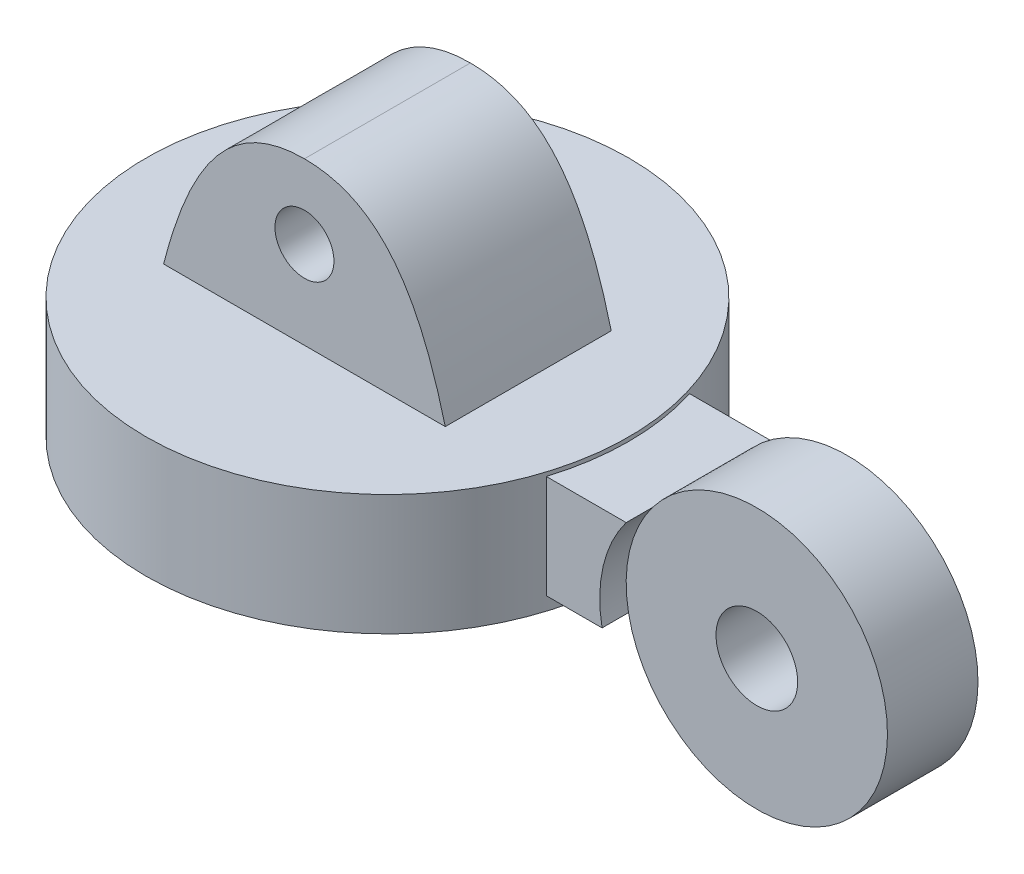
ISO-10303-21;
HEADER;
FILE_DESCRIPTION(('STEP AP214'),'2;1');
FILE_NAME('part.step','',(''),(''),'','','');
FILE_SCHEMA(('AUTOMOTIVE_DESIGN { 1 0 10303 214 1 1 1 1 }'));
ENDSEC;
DATA;
#1=APPLICATION_CONTEXT('core data for automotive mechanical design processes');
#2=APPLICATION_PROTOCOL_DEFINITION('international standard','automotive_design',2000,#1);
#3=PRODUCT_CONTEXT('',#1,'mechanical');
#4=PRODUCT('Part','Part','',(#3));
#5=PRODUCT_RELATED_PRODUCT_CATEGORY('part','',(#4));
#6=PRODUCT_DEFINITION_FORMATION('','',#4);
#7=PRODUCT_DEFINITION_CONTEXT('part definition',#1,'design');
#8=PRODUCT_DEFINITION('design','',#6,#7);
#9=PRODUCT_DEFINITION_SHAPE('','',#8);
#10=(LENGTH_UNIT() NAMED_UNIT(*) SI_UNIT(.MILLI.,.METRE.));
#11=(NAMED_UNIT(*) PLANE_ANGLE_UNIT() SI_UNIT($,.RADIAN.));
#12=(NAMED_UNIT(*) SI_UNIT($,.STERADIAN.) SOLID_ANGLE_UNIT());
#13=UNCERTAINTY_MEASURE_WITH_UNIT(LENGTH_MEASURE(1.E-05),#10,'distance_accuracy_value','');
#14=(GEOMETRIC_REPRESENTATION_CONTEXT(3) GLOBAL_UNCERTAINTY_ASSIGNED_CONTEXT((#13)) GLOBAL_UNIT_ASSIGNED_CONTEXT((#10,
#11,#12)) REPRESENTATION_CONTEXT('',''));
#15=CARTESIAN_POINT('',(0.,0.,0.));
#16=DIRECTION('',(0.,0.,1.));
#17=DIRECTION('',(1.,0.,0.));
#18=AXIS2_PLACEMENT_3D('',#15,#16,#17);
#19=CARTESIAN_POINT('',(54.96374577033,5.03116871619943,9.5));
#20=DIRECTION('',(0.,0.,-1.));
#21=DIRECTION('',(-1.,0.,0.));
#22=AXIS2_PLACEMENT_3D('',#19,#20,#21);
#23=CYLINDRICAL_SURFACE('',#22,17.3188793455624);
#24=DIRECTION('',(0.,0.,-1.));
#25=VECTOR('',#24,1.);
#26=CARTESIAN_POINT('',(41.1481021691568,15.4749024197898,9.5));
#27=LINE('',#26,#25);
#28=CARTESIAN_POINT('',(41.1481021691568,15.4749024197898,-6.));
#29=VERTEX_POINT('',#28);
#30=CARTESIAN_POINT('',(41.1481021691568,15.4749024197898,-9.5));
#31=VERTEX_POINT('',#30);
#32=EDGE_CURVE('E143',#29,#31,#27,.T.);
#33=ORIENTED_EDGE('',*,*,#32,.F.);
#34=CARTESIAN_POINT('',(54.96374577033,5.03116871619943,-6.));
#35=DIRECTION('',(0.,0.,1.));
#36=DIRECTION('',(1.,0.,0.));
#37=AXIS2_PLACEMENT_3D('',#34,#35,#36);
#38=CIRCLE('',#37,17.3188793455624);
#39=CARTESIAN_POINT('',(37.9520377160229,1.78380503758744,-6.));
#40=VERTEX_POINT('',#39);
#41=EDGE_CURVE('E134',#29,#40,#38,.T.);
#42=ORIENTED_EDGE('',*,*,#41,.T.);
#43=DIRECTION('',(0.,0.,-1.));
#44=VECTOR('',#43,1.);
#45=CARTESIAN_POINT('',(37.9520377160229,1.78380503758744,9.5));
#46=LINE('',#45,#44);
#47=CARTESIAN_POINT('',(37.9520377160229,1.78380503758744,-9.5));
#48=VERTEX_POINT('',#47);
#49=EDGE_CURVE('E323',#40,#48,#46,.T.);
#50=ORIENTED_EDGE('',*,*,#49,.T.);
#51=CARTESIAN_POINT('',(54.96374577033,5.03116871619943,-9.5));
#52=DIRECTION('',(0.,0.,1.));
#53=DIRECTION('',(1.,0.,0.));
#54=AXIS2_PLACEMENT_3D('',#51,#52,#53);
#55=CIRCLE('',#54,17.3188793455624);
#56=EDGE_CURVE('E145',#31,#48,#55,.T.);
#57=ORIENTED_EDGE('',*,*,#56,.F.);
#58=EDGE_LOOP('',(#33,#42,#50,#57));
#59=FACE_BOUND('',#58,.T.);
#60=ADVANCED_FACE('F35',(#59),#23,.F.);
#61=CARTESIAN_POINT('',(0.,16.,0.));
#62=DIRECTION('',(0.,1.,0.));
#63=DIRECTION('',(0.,0.,1.));
#64=AXIS2_PLACEMENT_3D('',#61,#62,#63);
#65=PLANE('',#64);
#66=CARTESIAN_POINT('',(0.,16.,0.));
#67=DIRECTION('',(0.,1.,0.));
#68=DIRECTION('',(0.,0.,1.));
#69=AXIS2_PLACEMENT_3D('',#66,#67,#68);
#70=CIRCLE('',#69,32.0074650346705);
#71=CARTESIAN_POINT('',(0.,16.,32.0074650346705));
#72=VERTEX_POINT('',#71);
#73=EDGE_CURVE('E316',#72,#72,#70,.T.);
#74=ORIENTED_EDGE('',*,*,#73,.T.);
#75=EDGE_LOOP('',(#74));
#76=FACE_BOUND('',#75,.T.);
#77=DIRECTION('',(1.,0.,0.));
#78=VECTOR('',#77,1.);
#79=CARTESIAN_POINT('',(18.6664529568385,16.,11.));
#80=LINE('',#79,#78);
#81=CARTESIAN_POINT('',(-18.6664529568385,16.,11.));
#82=VERTEX_POINT('',#81);
#83=CARTESIAN_POINT('',(18.6664529568385,16.,11.));
#84=VERTEX_POINT('',#83);
#85=EDGE_CURVE('E189',#82,#84,#80,.T.);
#86=ORIENTED_EDGE('',*,*,#85,.F.);
#87=DIRECTION('',(0.,0.,-1.));
#88=VECTOR('',#87,1.);
#89=CARTESIAN_POINT('',(-18.6664529568385,16.,11.));
#90=LINE('',#89,#88);
#91=CARTESIAN_POINT('',(-18.6664529568385,16.,-11.));
#92=VERTEX_POINT('',#91);
#93=EDGE_CURVE('E309',#82,#92,#90,.T.);
#94=ORIENTED_EDGE('',*,*,#93,.T.);
#95=DIRECTION('',(1.,0.,0.));
#96=VECTOR('',#95,1.);
#97=CARTESIAN_POINT('',(18.6664529568385,16.,-11.));
#98=LINE('',#97,#96);
#99=CARTESIAN_POINT('',(18.6664529568385,16.,-11.));
#100=VERTEX_POINT('',#99);
#101=EDGE_CURVE('E542',#92,#100,#98,.T.);
#102=ORIENTED_EDGE('',*,*,#101,.T.);
#103=DIRECTION('',(0.,0.,-1.));
#104=VECTOR('',#103,1.);
#105=CARTESIAN_POINT('',(18.6664529568385,16.,11.));
#106=LINE('',#105,#104);
#107=EDGE_CURVE('E529',#84,#100,#106,.T.);
#108=ORIENTED_EDGE('',*,*,#107,.F.);
#109=EDGE_LOOP('',(#86,#94,#102,#108));
#110=FACE_BOUND('',#109,.T.);
#111=ADVANCED_FACE('F218',(#76,#110),#65,.T.);
#112=CARTESIAN_POINT('',(0.,16.,0.));
#113=DIRECTION('',(0.,-1.,0.));
#114=DIRECTION('',(0.,0.,-1.));
#115=AXIS2_PLACEMENT_3D('',#112,#113,#114);
#116=CYLINDRICAL_SURFACE('',#115,32.0074650346705);
#117=CARTESIAN_POINT('',(0.,1.78380503758744,0.));
#118=DIRECTION('',(0.,1.,0.));
#119=DIRECTION('',(0.,0.,1.));
#120=AXIS2_PLACEMENT_3D('',#117,#118,#119);
#121=CIRCLE('',#120,32.0074650346705);
#122=CARTESIAN_POINT('',(30.5651405680663,1.78380503758744,9.5));
#123=VERTEX_POINT('',#122);
#124=CARTESIAN_POINT('',(30.5651405680663,1.78380503758744,-9.5));
#125=VERTEX_POINT('',#124);
#126=EDGE_CURVE('E174',#123,#125,#121,.T.);
#127=ORIENTED_EDGE('',*,*,#126,.F.);
#128=DIRECTION('',(0.,-1.,0.));
#129=VECTOR('',#128,1.);
#130=CARTESIAN_POINT('',(30.5651405680663,16.,9.5));
#131=LINE('',#130,#129);
#132=CARTESIAN_POINT('',(30.5651405680663,15.4749024197898,9.5));
#133=VERTEX_POINT('',#132);
#134=EDGE_CURVE('E56',#123,#133,#131,.F.);
#135=ORIENTED_EDGE('',*,*,#134,.T.);
#136=CARTESIAN_POINT('',(0.,15.4749024197898,0.));
#137=DIRECTION('',(0.,1.,0.));
#138=DIRECTION('',(0.,0.,1.));
#139=AXIS2_PLACEMENT_3D('',#136,#137,#138);
#140=CIRCLE('',#139,32.0074650346705);
#141=CARTESIAN_POINT('',(30.5651405680663,15.4749024197898,-9.5));
#142=VERTEX_POINT('',#141);
#143=EDGE_CURVE('E11',#133,#142,#140,.T.);
#144=ORIENTED_EDGE('',*,*,#143,.T.);
#145=DIRECTION('',(0.,-1.,0.));
#146=VECTOR('',#145,1.);
#147=CARTESIAN_POINT('',(30.5651405680663,16.,-9.5));
#148=LINE('',#147,#146);
#149=EDGE_CURVE('E163',#125,#142,#148,.F.);
#150=ORIENTED_EDGE('',*,*,#149,.F.);
#151=EDGE_LOOP('',(#127,#135,#144,#150));
#152=FACE_BOUND('',#151,.T.);
#153=ORIENTED_EDGE('',*,*,#73,.F.);
#154=EDGE_LOOP('',(#153));
#155=FACE_BOUND('',#154,.T.);
#156=CARTESIAN_POINT('',(0.,0.,0.));
#157=DIRECTION('',(0.,1.,0.));
#158=DIRECTION('',(0.,0.,1.));
#159=AXIS2_PLACEMENT_3D('',#156,#157,#158);
#160=CIRCLE('',#159,32.0074650346705);
#161=CARTESIAN_POINT('',(0.,0.,32.0074650346705));
#162=VERTEX_POINT('',#161);
#163=EDGE_CURVE('E314',#162,#162,#160,.T.);
#164=ORIENTED_EDGE('',*,*,#163,.T.);
#165=EDGE_LOOP('',(#164));
#166=FACE_BOUND('',#165,.T.);
#167=ADVANCED_FACE('F37',(#152,#155,#166),#116,.T.);
#168=CARTESIAN_POINT('',(0.,0.,0.));
#169=DIRECTION('',(0.,1.,0.));
#170=DIRECTION('',(0.,0.,1.));
#171=AXIS2_PLACEMENT_3D('',#168,#169,#170);
#172=PLANE('',#171);
#173=CARTESIAN_POINT('',(0.,0.,0.));
#174=DIRECTION('',(0.,-1.,0.));
#175=DIRECTION('',(0.,0.,-1.));
#176=AXIS2_PLACEMENT_3D('',#173,#174,#175);
#177=CIRCLE('',#176,29.2395080001266);
#178=CARTESIAN_POINT('',(0.,0.,-29.2395080001266));
#179=VERTEX_POINT('',#178);
#180=EDGE_CURVE('E303',#179,#179,#177,.T.);
#181=ORIENTED_EDGE('',*,*,#180,.F.);
#182=EDGE_LOOP('',(#181));
#183=FACE_BOUND('',#182,.T.);
#184=ORIENTED_EDGE('',*,*,#163,.F.);
#185=EDGE_LOOP('',(#184));
#186=FACE_BOUND('',#185,.T.);
#187=ADVANCED_FACE('F216',(#183,#186),#172,.F.);
#188=CARTESIAN_POINT('',(0.,3.,0.));
#189=DIRECTION('',(0.,-1.,0.));
#190=DIRECTION('',(0.,0.,-1.));
#191=AXIS2_PLACEMENT_3D('',#188,#189,#190);
#192=CYLINDRICAL_SURFACE('',#191,29.2395080001266);
#193=CARTESIAN_POINT('',(0.,3.,0.));
#194=DIRECTION('',(0.,-1.,0.));
#195=DIRECTION('',(0.,0.,-1.));
#196=AXIS2_PLACEMENT_3D('',#193,#194,#195);
#197=CIRCLE('',#196,29.2395080001266);
#198=CARTESIAN_POINT('',(27.653188389216,3.,9.5));
#199=VERTEX_POINT('',#198);
#200=CARTESIAN_POINT('',(27.653188389216,3.,-9.5));
#201=VERTEX_POINT('',#200);
#202=EDGE_CURVE('E295',#199,#201,#197,.T.);
#203=ORIENTED_EDGE('',*,*,#202,.F.);
#204=DIRECTION('',(0.,-1.,0.));
#205=VECTOR('',#204,1.);
#206=CARTESIAN_POINT('',(27.653188389216,3.,9.5));
#207=LINE('',#206,#205);
#208=CARTESIAN_POINT('',(27.653188389216,1.78380503758744,9.5));
#209=VERTEX_POINT('',#208);
#210=EDGE_CURVE('E168',#199,#209,#207,.T.);
#211=ORIENTED_EDGE('',*,*,#210,.T.);
#212=CARTESIAN_POINT('',(0.,1.78380503758744,0.));
#213=DIRECTION('',(0.,1.,0.));
#214=DIRECTION('',(0.,0.,1.));
#215=AXIS2_PLACEMENT_3D('',#212,#213,#214);
#216=CIRCLE('',#215,29.2395080001266);
#217=CARTESIAN_POINT('',(27.653188389216,1.78380503758744,-9.5));
#218=VERTEX_POINT('',#217);
#219=EDGE_CURVE('E172',#218,#209,#216,.F.);
#220=ORIENTED_EDGE('',*,*,#219,.F.);
#221=DIRECTION('',(0.,-1.,0.));
#222=VECTOR('',#221,1.);
#223=CARTESIAN_POINT('',(27.653188389216,3.,-9.5));
#224=LINE('',#223,#222);
#225=EDGE_CURVE('E161',#201,#218,#224,.T.);
#226=ORIENTED_EDGE('',*,*,#225,.F.);
#227=EDGE_LOOP('',(#203,#211,#220,#226));
#228=FACE_BOUND('',#227,.T.);
#229=ORIENTED_EDGE('',*,*,#180,.T.);
#230=EDGE_LOOP('',(#229));
#231=FACE_BOUND('',#230,.T.);
#232=ADVANCED_FACE('F212',(#228,#231),#192,.F.);
#233=CARTESIAN_POINT('',(0.,3.,0.));
#234=DIRECTION('',(0.,-1.,0.));
#235=DIRECTION('',(0.,0.,-1.));
#236=AXIS2_PLACEMENT_3D('',#233,#234,#235);
#237=PLANE('',#236);
#238=DIRECTION('',(-1.,0.,0.));
#239=VECTOR('',#238,1.);
#240=CARTESIAN_POINT('',(0.,3.,9.5));
#241=LINE('',#240,#239);
#242=CARTESIAN_POINT('',(25.3389228621008,3.,9.5));
#243=VERTEX_POINT('',#242);
#244=EDGE_CURVE('E166',#199,#243,#241,.T.);
#245=ORIENTED_EDGE('',*,*,#244,.F.);
#246=ORIENTED_EDGE('',*,*,#202,.T.);
#247=DIRECTION('',(-1.,0.,0.));
#248=VECTOR('',#247,1.);
#249=CARTESIAN_POINT('',(0.,3.,-9.5));
#250=LINE('',#249,#248);
#251=CARTESIAN_POINT('',(25.3389228621008,3.,-9.5));
#252=VERTEX_POINT('',#251);
#253=EDGE_CURVE('E155',#201,#252,#250,.T.);
#254=ORIENTED_EDGE('',*,*,#253,.T.);
#255=CARTESIAN_POINT('',(-0.468052939027075,3.,0.));
#256=DIRECTION('',(0.,-1.,0.));
#257=DIRECTION('',(0.,0.,-1.));
#258=AXIS2_PLACEMENT_3D('',#255,#256,#257);
#259=CIRCLE('',#258,27.5);
#260=EDGE_CURVE('E302',#243,#252,#259,.T.);
#261=ORIENTED_EDGE('',*,*,#260,.F.);
#262=EDGE_LOOP('',(#245,#246,#254,#261));
#263=FACE_BOUND('',#262,.T.);
#264=ADVANCED_FACE('F208',(#263),#237,.T.);
#265=CARTESIAN_POINT('',(-0.468052939027075,3.,0.));
#266=DIRECTION('',(0.,-1.,0.));
#267=DIRECTION('',(0.,0.,-1.));
#268=AXIS2_PLACEMENT_3D('',#265,#266,#267);
#269=CYLINDRICAL_SURFACE('',#268,27.5);
#270=DIRECTION('',(0.,-1.,0.));
#271=VECTOR('',#270,1.);
#272=CARTESIAN_POINT('',(25.3389228621008,3.,9.5));
#273=LINE('',#272,#271);
#274=CARTESIAN_POINT('',(25.3389228621008,1.78380503758744,9.5));
#275=VERTEX_POINT('',#274);
#276=EDGE_CURVE('E43',#243,#275,#273,.T.);
#277=ORIENTED_EDGE('',*,*,#276,.F.);
#278=ORIENTED_EDGE('',*,*,#260,.T.);
#279=DIRECTION('',(0.,-1.,0.));
#280=VECTOR('',#279,1.);
#281=CARTESIAN_POINT('',(25.3389228621008,3.,-9.5));
#282=LINE('',#281,#280);
#283=CARTESIAN_POINT('',(25.3389228621008,1.78380503758744,-9.5));
#284=VERTEX_POINT('',#283);
#285=EDGE_CURVE('E319',#252,#284,#282,.T.);
#286=ORIENTED_EDGE('',*,*,#285,.T.);
#287=CARTESIAN_POINT('',(-0.468052939027075,1.78380503758744,0.));
#288=DIRECTION('',(0.,1.,0.));
#289=DIRECTION('',(0.,0.,1.));
#290=AXIS2_PLACEMENT_3D('',#287,#288,#289);
#291=CIRCLE('',#290,27.5);
#292=EDGE_CURVE('E288',#284,#275,#291,.F.);
#293=ORIENTED_EDGE('',*,*,#292,.T.);
#294=EDGE_LOOP('',(#277,#278,#286,#293));
#295=FACE_BOUND('',#294,.T.);
#296=CARTESIAN_POINT('',(-0.468052939027075,0.,0.));
#297=DIRECTION('',(0.,-1.,0.));
#298=DIRECTION('',(0.,0.,-1.));
#299=AXIS2_PLACEMENT_3D('',#296,#297,#298);
#300=CIRCLE('',#299,27.5);
#301=CARTESIAN_POINT('',(-0.468052939027075,0.,-27.5));
#302=VERTEX_POINT('',#301);
#303=EDGE_CURVE('E304',#302,#302,#300,.T.);
#304=ORIENTED_EDGE('',*,*,#303,.F.);
#305=EDGE_LOOP('',(#304));
#306=FACE_BOUND('',#305,.T.);
#307=ADVANCED_FACE('F204',(#295,#306),#269,.T.);
#308=ORIENTED_EDGE('',*,*,#303,.T.);
#309=EDGE_LOOP('',(#308));
#310=FACE_BOUND('',#309,.T.);
#311=ADVANCED_FACE('F207',(#310),#172,.F.);
#312=CARTESIAN_POINT('',(-11.6227277255258,31.9146270543991,11.));
#313=DIRECTION('',(0.,0.,1.));
#314=DIRECTION('',(1.,0.,0.));
#315=AXIS2_PLACEMENT_3D('',#312,#313,#314);
#316=PLANE('',#315);
#317=CARTESIAN_POINT('',(0.,37.4124179490394,11.));
#318=CARTESIAN_POINT('',(-9.66036103965406,37.4124179490394,11.));
#319=CARTESIAN_POINT('',(-15.1114285761352,29.8891148796784,11.));
#320=CARTESIAN_POINT('',(-18.6664529568385,16.,11.));
#321=B_SPLINE_CURVE_WITH_KNOTS('',3,(#317,#318,#319,#320),.UNSPECIFIED.,.F.,.F.,(4,4),(0.,1.),.UNSPECIFIED.);
#322=CARTESIAN_POINT('',(0.,37.4124179490394,11.));
#323=VERTEX_POINT('',#322);
#324=EDGE_CURVE('E184',#323,#82,#321,.T.);
#325=ORIENTED_EDGE('',*,*,#324,.T.);
#326=ORIENTED_EDGE('',*,*,#85,.T.);
#327=CARTESIAN_POINT('',(18.6664529568385,16.,11.));
#328=CARTESIAN_POINT('',(15.1114285761352,29.8891148796784,11.));
#329=CARTESIAN_POINT('',(9.66036103965406,37.4124179490394,11.));
#330=CARTESIAN_POINT('',(0.,37.4124179490394,11.));
#331=B_SPLINE_CURVE_WITH_KNOTS('',3,(#327,#328,#329,#330),.UNSPECIFIED.,.F.,.F.,(4,4),(0.,1.),.UNSPECIFIED.);
#332=EDGE_CURVE('E521',#84,#323,#331,.T.);
#333=ORIENTED_EDGE('',*,*,#332,.T.);
#334=EDGE_LOOP('',(#325,#326,#333));
#335=FACE_BOUND('',#334,.T.);
#336=CARTESIAN_POINT('',(0.,27.6027847450147,11.));
#337=DIRECTION('',(0.,0.,1.));
#338=DIRECTION('',(1.,0.,0.));
#339=AXIS2_PLACEMENT_3D('',#336,#337,#338);
#340=CIRCLE('',#339,3.90970017860598);
#341=CARTESIAN_POINT('',(3.90970017860601,27.6027847450147,11.));
#342=VERTEX_POINT('',#341);
#343=EDGE_CURVE('E178',#342,#342,#340,.T.);
#344=ORIENTED_EDGE('',*,*,#343,.F.);
#345=EDGE_LOOP('',(#344));
#346=FACE_BOUND('',#345,.T.);
#347=ADVANCED_FACE('F229',(#335,#346),#316,.T.);
#348=CARTESIAN_POINT('',(-11.6227277255258,31.9146270543991,-11.));
#349=DIRECTION('',(0.,0.,1.));
#350=DIRECTION('',(1.,0.,0.));
#351=AXIS2_PLACEMENT_3D('',#348,#349,#350);
#352=PLANE('',#351);
#353=CARTESIAN_POINT('',(0.,37.4124179490394,-11.));
#354=CARTESIAN_POINT('',(-9.66036103965406,37.4124179490394,-11.));
#355=CARTESIAN_POINT('',(-15.1114285761352,29.8891148796784,-11.));
#356=CARTESIAN_POINT('',(-18.6664529568385,16.,-11.));
#357=B_SPLINE_CURVE_WITH_KNOTS('',3,(#353,#354,#355,#356),.UNSPECIFIED.,.F.,.F.,(4,4),(0.,1.),.UNSPECIFIED.);
#358=CARTESIAN_POINT('',(0.,37.4124179490394,-11.));
#359=VERTEX_POINT('',#358);
#360=EDGE_CURVE('E181',#359,#92,#357,.T.);
#361=ORIENTED_EDGE('',*,*,#360,.F.);
#362=CARTESIAN_POINT('',(18.6664529568385,16.,-11.));
#363=CARTESIAN_POINT('',(15.1114285761352,29.8891148796784,-11.));
#364=CARTESIAN_POINT('',(9.66036103965406,37.4124179490394,-11.));
#365=CARTESIAN_POINT('',(0.,37.4124179490394,-11.));
#366=B_SPLINE_CURVE_WITH_KNOTS('',3,(#362,#363,#364,#365),.UNSPECIFIED.,.F.,.F.,(4,4),(0.,1.),.UNSPECIFIED.);
#367=EDGE_CURVE('E190',#100,#359,#366,.T.);
#368=ORIENTED_EDGE('',*,*,#367,.F.);
#369=ORIENTED_EDGE('',*,*,#101,.F.);
#370=EDGE_LOOP('',(#361,#368,#369));
#371=FACE_BOUND('',#370,.T.);
#372=CARTESIAN_POINT('',(0.,27.6027847450147,-11.));
#373=DIRECTION('',(0.,0.,1.));
#374=DIRECTION('',(1.,0.,0.));
#375=AXIS2_PLACEMENT_3D('',#372,#373,#374);
#376=CIRCLE('',#375,3.90970017860598);
#377=CARTESIAN_POINT('',(3.90970017860601,27.6027847450147,-11.));
#378=VERTEX_POINT('',#377);
#379=EDGE_CURVE('E177',#378,#378,#376,.T.);
#380=ORIENTED_EDGE('',*,*,#379,.T.);
#381=EDGE_LOOP('',(#380));
#382=FACE_BOUND('',#381,.T.);
#383=ADVANCED_FACE('F201',(#371,#382),#352,.F.);
#384=DIRECTION('',(0.,0.,-1.));
#385=VECTOR('',#384,1.);
#386=SURFACE_OF_LINEAR_EXTRUSION('',#321,#385);
#387=ORIENTED_EDGE('',*,*,#360,.T.);
#388=ORIENTED_EDGE('',*,*,#93,.F.);
#389=ORIENTED_EDGE('',*,*,#324,.F.);
#390=DIRECTION('',(0.,0.,-1.));
#391=VECTOR('',#390,1.);
#392=CARTESIAN_POINT('',(0.,37.4124179490394,11.));
#393=LINE('',#392,#391);
#394=EDGE_CURVE('E530',#323,#359,#393,.T.);
#395=ORIENTED_EDGE('',*,*,#394,.T.);
#396=EDGE_LOOP('',(#387,#388,#389,#395));
#397=FACE_BOUND('',#396,.T.);
#398=ADVANCED_FACE('F196',(#397),#386,.F.);
#399=DIRECTION('',(0.,0.,-1.));
#400=VECTOR('',#399,1.);
#401=SURFACE_OF_LINEAR_EXTRUSION('',#331,#400);
#402=ORIENTED_EDGE('',*,*,#367,.T.);
#403=ORIENTED_EDGE('',*,*,#394,.F.);
#404=ORIENTED_EDGE('',*,*,#332,.F.);
#405=ORIENTED_EDGE('',*,*,#107,.T.);
#406=EDGE_LOOP('',(#402,#403,#404,#405));
#407=FACE_BOUND('',#406,.T.);
#408=ADVANCED_FACE('F200',(#407),#401,.F.);
#409=CARTESIAN_POINT('',(0.,27.6027847450147,11.));
#410=DIRECTION('',(0.,0.,-1.));
#411=DIRECTION('',(-1.,0.,0.));
#412=AXIS2_PLACEMENT_3D('',#409,#410,#411);
#413=CYLINDRICAL_SURFACE('',#412,3.90970017860598);
#414=ORIENTED_EDGE('',*,*,#343,.T.);
#415=EDGE_LOOP('',(#414));
#416=FACE_BOUND('',#415,.T.);
#417=ORIENTED_EDGE('',*,*,#379,.F.);
#418=EDGE_LOOP('',(#417));
#419=FACE_BOUND('',#418,.T.);
#420=ADVANCED_FACE('F332',(#416,#419),#413,.F.);
#421=CARTESIAN_POINT('',(0.,0.,9.5));
#422=DIRECTION('',(0.,0.,1.));
#423=DIRECTION('',(1.,0.,0.));
#424=AXIS2_PLACEMENT_3D('',#421,#422,#423);
#425=PLANE('',#424);
#426=ORIENTED_EDGE('',*,*,#210,.F.);
#427=ORIENTED_EDGE('',*,*,#244,.T.);
#428=ORIENTED_EDGE('',*,*,#276,.T.);
#429=DIRECTION('',(1.,0.,0.));
#430=VECTOR('',#429,1.);
#431=CARTESIAN_POINT('',(0.,1.78380503758744,9.5));
#432=LINE('',#431,#430);
#433=EDGE_CURVE('E274',#275,#209,#432,.T.);
#434=ORIENTED_EDGE('',*,*,#433,.T.);
#435=EDGE_LOOP('',(#426,#427,#428,#434));
#436=FACE_BOUND('',#435,.T.);
#437=ADVANCED_FACE('F298',(#436),#425,.T.);
#438=CARTESIAN_POINT('',(0.,0.,-9.5));
#439=DIRECTION('',(0.,0.,1.));
#440=DIRECTION('',(1.,0.,0.));
#441=AXIS2_PLACEMENT_3D('',#438,#439,#440);
#442=PLANE('',#441);
#443=ORIENTED_EDGE('',*,*,#253,.F.);
#444=ORIENTED_EDGE('',*,*,#225,.T.);
#445=DIRECTION('',(1.,0.,0.));
#446=VECTOR('',#445,1.);
#447=CARTESIAN_POINT('',(0.,1.78380503758744,-9.5));
#448=LINE('',#447,#446);
#449=EDGE_CURVE('E271',#284,#218,#448,.T.);
#450=ORIENTED_EDGE('',*,*,#449,.F.);
#451=ORIENTED_EDGE('',*,*,#285,.F.);
#452=EDGE_LOOP('',(#443,#444,#450,#451));
#453=FACE_BOUND('',#452,.T.);
#454=ADVANCED_FACE('F251',(#453),#442,.F.);
#455=CARTESIAN_POINT('',(0.,1.78380503758744,9.5));
#456=DIRECTION('',(0.,1.,0.));
#457=DIRECTION('',(0.,0.,1.));
#458=AXIS2_PLACEMENT_3D('',#455,#456,#457);
#459=PLANE('',#458);
#460=ORIENTED_EDGE('',*,*,#449,.T.);
#461=ORIENTED_EDGE('',*,*,#219,.T.);
#462=ORIENTED_EDGE('',*,*,#433,.F.);
#463=ORIENTED_EDGE('',*,*,#292,.F.);
#464=EDGE_LOOP('',(#460,#461,#462,#463));
#465=FACE_BOUND('',#464,.T.);
#466=ADVANCED_FACE('F284',(#465),#459,.F.);
#467=CARTESIAN_POINT('',(0.,15.4749024197898,9.5));
#468=DIRECTION('',(0.,1.,0.));
#469=DIRECTION('',(0.,0.,1.));
#470=AXIS2_PLACEMENT_3D('',#467,#468,#469);
#471=PLANE('',#470);
#472=ORIENTED_EDGE('',*,*,#143,.F.);
#473=DIRECTION('',(1.,0.,0.));
#474=VECTOR('',#473,1.);
#475=CARTESIAN_POINT('',(0.,15.4749024197898,9.5));
#476=LINE('',#475,#474);
#477=CARTESIAN_POINT('',(41.1481021691568,15.4749024197898,9.5));
#478=VERTEX_POINT('',#477);
#479=EDGE_CURVE('E270',#133,#478,#476,.T.);
#480=ORIENTED_EDGE('',*,*,#479,.T.);
#481=CARTESIAN_POINT('',(41.1481021691568,15.4749024197898,6.));
#482=VERTEX_POINT('',#481);
#483=EDGE_CURVE('E151',#478,#482,#27,.T.);
#484=ORIENTED_EDGE('',*,*,#483,.T.);
#485=EDGE_CURVE('E129',#482,#29,#27,.T.);
#486=ORIENTED_EDGE('',*,*,#485,.T.);
#487=ORIENTED_EDGE('',*,*,#32,.T.);
#488=DIRECTION('',(1.,0.,0.));
#489=VECTOR('',#488,1.);
#490=CARTESIAN_POINT('',(0.,15.4749024197898,-9.5));
#491=LINE('',#490,#489);
#492=EDGE_CURVE('E262',#142,#31,#491,.T.);
#493=ORIENTED_EDGE('',*,*,#492,.F.);
#494=EDGE_LOOP('',(#472,#480,#484,#486,#487,#493));
#495=FACE_BOUND('',#494,.T.);
#496=ADVANCED_FACE('F153',(#495),#471,.T.);
#497=CARTESIAN_POINT('',(37.9520377160229,1.78380503758744,9.5));
#498=VERTEX_POINT('',#497);
#499=EDGE_CURVE('E273',#123,#498,#432,.T.);
#500=ORIENTED_EDGE('',*,*,#499,.F.);
#501=ORIENTED_EDGE('',*,*,#126,.T.);
#502=EDGE_CURVE('E276',#125,#48,#448,.T.);
#503=ORIENTED_EDGE('',*,*,#502,.T.);
#504=ORIENTED_EDGE('',*,*,#49,.F.);
#505=CARTESIAN_POINT('',(37.9520377160229,1.78380503758744,6.));
#506=VERTEX_POINT('',#505);
#507=EDGE_CURVE('E132',#506,#40,#46,.T.);
#508=ORIENTED_EDGE('',*,*,#507,.F.);
#509=EDGE_CURVE('E149',#498,#506,#46,.T.);
#510=ORIENTED_EDGE('',*,*,#509,.F.);
#511=EDGE_LOOP('',(#500,#501,#503,#504,#508,#510));
#512=FACE_BOUND('',#511,.T.);
#513=ADVANCED_FACE('F331',(#512),#459,.F.);
#514=ORIENTED_EDGE('',*,*,#134,.F.);
#515=ORIENTED_EDGE('',*,*,#499,.T.);
#516=CARTESIAN_POINT('',(54.96374577033,5.03116871619943,9.5));
#517=DIRECTION('',(0.,0.,1.));
#518=DIRECTION('',(1.,0.,0.));
#519=AXIS2_PLACEMENT_3D('',#516,#517,#518);
#520=CIRCLE('',#519,17.3188793455624);
#521=EDGE_CURVE('E268',#478,#498,#520,.T.);
#522=ORIENTED_EDGE('',*,*,#521,.F.);
#523=ORIENTED_EDGE('',*,*,#479,.F.);
#524=EDGE_LOOP('',(#514,#515,#522,#523));
#525=FACE_BOUND('',#524,.T.);
#526=ADVANCED_FACE('F248',(#525),#425,.T.);
#527=ORIENTED_EDGE('',*,*,#502,.F.);
#528=ORIENTED_EDGE('',*,*,#149,.T.);
#529=ORIENTED_EDGE('',*,*,#492,.T.);
#530=ORIENTED_EDGE('',*,*,#56,.T.);
#531=EDGE_LOOP('',(#527,#528,#529,#530));
#532=FACE_BOUND('',#531,.T.);
#533=ADVANCED_FACE('F240',(#532),#442,.F.);
#534=CARTESIAN_POINT('',(54.96374577033,5.03116871619943,6.));
#535=DIRECTION('',(0.,0.,1.));
#536=DIRECTION('',(1.,0.,0.));
#537=AXIS2_PLACEMENT_3D('',#534,#535,#536);
#538=CIRCLE('',#537,17.3188793455624);
#539=EDGE_CURVE('E255',#482,#506,#538,.T.);
#540=ORIENTED_EDGE('',*,*,#539,.F.);
#541=ORIENTED_EDGE('',*,*,#483,.F.);
#542=ORIENTED_EDGE('',*,*,#521,.T.);
#543=ORIENTED_EDGE('',*,*,#509,.T.);
#544=EDGE_LOOP('',(#540,#541,#542,#543));
#545=FACE_BOUND('',#544,.T.);
#546=ADVANCED_FACE('F233',(#545),#23,.F.);
#547=CARTESIAN_POINT('',(54.96374577033,5.03116871619943,6.));
#548=DIRECTION('',(0.,0.,-1.));
#549=DIRECTION('',(-1.,0.,0.));
#550=AXIS2_PLACEMENT_3D('',#547,#548,#549);
#551=CYLINDRICAL_SURFACE('',#550,5.41173144118846);
#552=CARTESIAN_POINT('',(54.96374577033,5.03116871619943,6.));
#553=DIRECTION('',(0.,0.,1.));
#554=DIRECTION('',(1.,0.,0.));
#555=AXIS2_PLACEMENT_3D('',#552,#553,#554);
#556=CIRCLE('',#555,5.41173144118846);
#557=CARTESIAN_POINT('',(60.3754772115185,5.03116871619943,6.));
#558=VERTEX_POINT('',#557);
#559=EDGE_CURVE('E141',#558,#558,#556,.T.);
#560=ORIENTED_EDGE('',*,*,#559,.T.);
#561=EDGE_LOOP('',(#560));
#562=FACE_BOUND('',#561,.T.);
#563=CARTESIAN_POINT('',(54.96374577033,5.03116871619943,-6.));
#564=DIRECTION('',(0.,0.,1.));
#565=DIRECTION('',(1.,0.,0.));
#566=AXIS2_PLACEMENT_3D('',#563,#564,#565);
#567=CIRCLE('',#566,5.41173144118846);
#568=CARTESIAN_POINT('',(60.3754772115185,5.03116871619943,-6.));
#569=VERTEX_POINT('',#568);
#570=EDGE_CURVE('E135',#569,#569,#567,.T.);
#571=ORIENTED_EDGE('',*,*,#570,.F.);
#572=EDGE_LOOP('',(#571));
#573=FACE_BOUND('',#572,.T.);
#574=ADVANCED_FACE('F239',(#562,#573),#551,.F.);
#575=CARTESIAN_POINT('',(54.96374577033,5.03116871619943,6.));
#576=DIRECTION('',(0.,0.,-1.));
#577=DIRECTION('',(-1.,0.,0.));
#578=AXIS2_PLACEMENT_3D('',#575,#576,#577);
#579=CYLINDRICAL_SURFACE('',#578,17.3188793455624);
#580=ORIENTED_EDGE('',*,*,#485,.F.);
#581=EDGE_CURVE('E260',#506,#482,#538,.T.);
#582=ORIENTED_EDGE('',*,*,#581,.F.);
#583=ORIENTED_EDGE('',*,*,#507,.T.);
#584=EDGE_CURVE('E49',#40,#29,#38,.T.);
#585=ORIENTED_EDGE('',*,*,#584,.T.);
#586=EDGE_LOOP('',(#580,#582,#583,#585));
#587=FACE_BOUND('',#586,.T.);
#588=ADVANCED_FACE('F127',(#587),#579,.T.);
#589=CARTESIAN_POINT('',(0.,0.,6.));
#590=DIRECTION('',(0.,0.,1.));
#591=DIRECTION('',(1.,0.,0.));
#592=AXIS2_PLACEMENT_3D('',#589,#590,#591);
#593=PLANE('',#592);
#594=ORIENTED_EDGE('',*,*,#559,.F.);
#595=EDGE_LOOP('',(#594));
#596=FACE_BOUND('',#595,.T.);
#597=ORIENTED_EDGE('',*,*,#539,.T.);
#598=ORIENTED_EDGE('',*,*,#581,.T.);
#599=EDGE_LOOP('',(#597,#598));
#600=FACE_BOUND('',#599,.T.);
#601=ADVANCED_FACE('F378',(#596,#600),#593,.T.);
#602=CARTESIAN_POINT('',(0.,0.,-6.));
#603=DIRECTION('',(0.,0.,1.));
#604=DIRECTION('',(1.,0.,0.));
#605=AXIS2_PLACEMENT_3D('',#602,#603,#604);
#606=PLANE('',#605);
#607=ORIENTED_EDGE('',*,*,#570,.T.);
#608=EDGE_LOOP('',(#607));
#609=FACE_BOUND('',#608,.T.);
#610=ORIENTED_EDGE('',*,*,#41,.F.);
#611=ORIENTED_EDGE('',*,*,#584,.F.);
#612=EDGE_LOOP('',(#610,#611));
#613=FACE_BOUND('',#612,.T.);
#614=ADVANCED_FACE('F138',(#609,#613),#606,.F.);
#615=CLOSED_SHELL('',(#60,#111,#167,#187,#232,#264,#307,#311,#347,#383,#398,#408,#420,#437,#454,
#466,#496,#513,#526,#533,#546,#574,#588,#601,#614));
#616=MANIFOLD_SOLID_BREP('B2',#615);
#617=ADVANCED_BREP_SHAPE_REPRESENTATION('',(#18,#616),#14);
#618=SHAPE_DEFINITION_REPRESENTATION(#9,#617);
ENDSEC;
END-ISO-10303-21;
